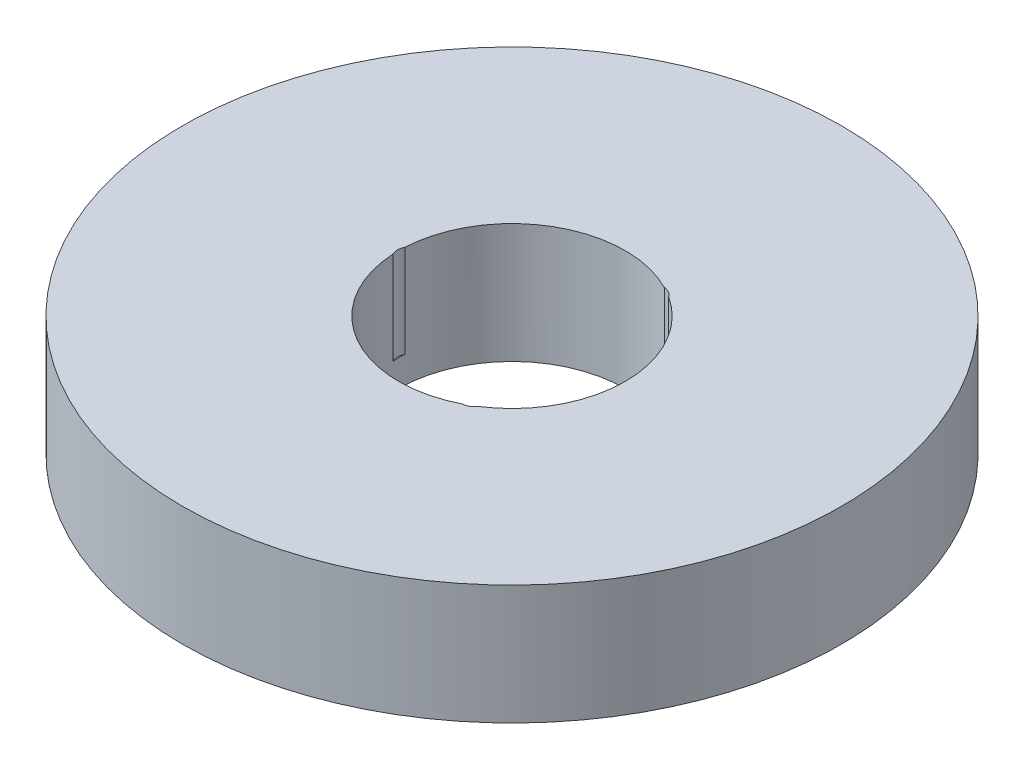
ISO-10303-21;
HEADER;
FILE_DESCRIPTION(('STEP AP214'),'2;1');
FILE_NAME('part.step','',(''),(''),'','','');
FILE_SCHEMA(('AUTOMOTIVE_DESIGN { 1 0 10303 214 1 1 1 1 }'));
ENDSEC;
DATA;
#1=APPLICATION_CONTEXT('core data for automotive mechanical design processes');
#2=APPLICATION_PROTOCOL_DEFINITION('international standard','automotive_design',2000,#1);
#3=PRODUCT_CONTEXT('',#1,'mechanical');
#4=PRODUCT('Part','Part','',(#3));
#5=PRODUCT_RELATED_PRODUCT_CATEGORY('part','',(#4));
#6=PRODUCT_DEFINITION_FORMATION('','',#4);
#7=PRODUCT_DEFINITION_CONTEXT('part definition',#1,'design');
#8=PRODUCT_DEFINITION('design','',#6,#7);
#9=PRODUCT_DEFINITION_SHAPE('','',#8);
#10=(LENGTH_UNIT() NAMED_UNIT(*) SI_UNIT(.MILLI.,.METRE.));
#11=(NAMED_UNIT(*) PLANE_ANGLE_UNIT() SI_UNIT($,.RADIAN.));
#12=(NAMED_UNIT(*) SI_UNIT($,.STERADIAN.) SOLID_ANGLE_UNIT());
#13=UNCERTAINTY_MEASURE_WITH_UNIT(LENGTH_MEASURE(1.E-05),#10,'distance_accuracy_value','');
#14=(GEOMETRIC_REPRESENTATION_CONTEXT(3) GLOBAL_UNCERTAINTY_ASSIGNED_CONTEXT((#13)) GLOBAL_UNIT_ASSIGNED_CONTEXT((#10,
#11,#12)) REPRESENTATION_CONTEXT('',''));
#15=CARTESIAN_POINT('',(0.,0.,0.));
#16=DIRECTION('',(0.,0.,1.));
#17=DIRECTION('',(1.,0.,0.));
#18=AXIS2_PLACEMENT_3D('',#15,#16,#17);
#19=CARTESIAN_POINT('',(0.,29.,0.));
#20=DIRECTION('',(0.,-1.,0.));
#21=DIRECTION('',(0.,0.,-1.));
#22=AXIS2_PLACEMENT_3D('',#19,#20,#21);
#23=CYLINDRICAL_SURFACE('',#22,80.);
#24=CARTESIAN_POINT('',(0.,29.,0.));
#25=DIRECTION('',(0.,1.,0.));
#26=DIRECTION('',(0.,0.,1.));
#27=AXIS2_PLACEMENT_3D('',#24,#25,#26);
#28=CIRCLE('',#27,80.);
#29=CARTESIAN_POINT('',(0.,29.,-80.));
#30=VERTEX_POINT('',#29);
#31=EDGE_CURVE('E130',#30,#30,#28,.T.);
#32=CARTESIAN_POINT('',(0.,0.,0.));
#33=DIRECTION('',(0.,1.,0.));
#34=DIRECTION('',(0.,0.,1.));
#35=AXIS2_PLACEMENT_3D('',#32,#33,#34);
#36=CIRCLE('',#35,80.);
#37=CARTESIAN_POINT('',(0.,0.,-80.));
#38=VERTEX_POINT('',#37);
#39=EDGE_CURVE('E117',#38,#38,#36,.T.);
#40=CARTESIAN_POINT('',(0.,29.,-80.));
#41=CARTESIAN_POINT('',(0.,28.6979166666667,-80.));
#42=CARTESIAN_POINT('',(0.,28.3958333333333,-80.));
#43=CARTESIAN_POINT('',(0.,27.7916666666667,-80.));
#44=CARTESIAN_POINT('',(0.,27.4895833333333,-80.));
#45=CARTESIAN_POINT('',(0.,26.8854166666667,-80.));
#46=CARTESIAN_POINT('',(0.,26.5833333333333,-80.));
#47=CARTESIAN_POINT('',(0.,25.9791666666667,-80.));
#48=CARTESIAN_POINT('',(0.,25.6770833333333,-80.));
#49=CARTESIAN_POINT('',(0.,25.0729166666667,-80.));
#50=CARTESIAN_POINT('',(0.,24.7708333333333,-80.));
#51=CARTESIAN_POINT('',(0.,24.1666666666667,-80.));
#52=CARTESIAN_POINT('',(0.,23.8645833333333,-80.));
#53=CARTESIAN_POINT('',(0.,23.2604166666667,-80.));
#54=CARTESIAN_POINT('',(0.,22.9583333333333,-80.));
#55=CARTESIAN_POINT('',(0.,22.3541666666667,-80.));
#56=CARTESIAN_POINT('',(0.,22.0520833333333,-80.));
#57=CARTESIAN_POINT('',(0.,21.4479166666667,-80.));
#58=CARTESIAN_POINT('',(0.,21.1458333333333,-80.));
#59=CARTESIAN_POINT('',(0.,20.5416666666667,-80.));
#60=CARTESIAN_POINT('',(0.,20.2395833333333,-80.));
#61=CARTESIAN_POINT('',(0.,19.6354166666667,-80.));
#62=CARTESIAN_POINT('',(0.,19.3333333333333,-80.));
#63=CARTESIAN_POINT('',(0.,18.7291666666667,-80.));
#64=CARTESIAN_POINT('',(0.,18.4270833333333,-80.));
#65=CARTESIAN_POINT('',(0.,17.8229166666667,-80.));
#66=CARTESIAN_POINT('',(0.,17.5208333333333,-80.));
#67=CARTESIAN_POINT('',(0.,16.9166666666667,-80.));
#68=CARTESIAN_POINT('',(0.,16.6145833333333,-80.));
#69=CARTESIAN_POINT('',(0.,16.0104166666667,-80.));
#70=CARTESIAN_POINT('',(0.,15.7083333333333,-80.));
#71=CARTESIAN_POINT('',(0.,15.1041666666667,-80.));
#72=CARTESIAN_POINT('',(0.,14.8020833333333,-80.));
#73=CARTESIAN_POINT('',(0.,14.1979166666667,-80.));
#74=CARTESIAN_POINT('',(0.,13.8958333333333,-80.));
#75=CARTESIAN_POINT('',(0.,13.2916666666667,-80.));
#76=CARTESIAN_POINT('',(0.,12.9895833333333,-80.));
#77=CARTESIAN_POINT('',(0.,12.3854166666667,-80.));
#78=CARTESIAN_POINT('',(0.,12.0833333333333,-80.));
#79=CARTESIAN_POINT('',(0.,11.4791666666667,-80.));
#80=CARTESIAN_POINT('',(0.,11.1770833333333,-80.));
#81=CARTESIAN_POINT('',(0.,10.5729166666667,-80.));
#82=CARTESIAN_POINT('',(0.,10.2708333333333,-80.));
#83=CARTESIAN_POINT('',(0.,9.66666666666667,-80.));
#84=CARTESIAN_POINT('',(0.,9.36458333333333,-80.));
#85=CARTESIAN_POINT('',(0.,8.76041666666667,-80.));
#86=CARTESIAN_POINT('',(0.,8.45833333333333,-80.));
#87=CARTESIAN_POINT('',(0.,7.85416666666667,-80.));
#88=CARTESIAN_POINT('',(0.,7.55208333333333,-80.));
#89=CARTESIAN_POINT('',(0.,6.94791666666667,-80.));
#90=CARTESIAN_POINT('',(0.,6.64583333333333,-80.));
#91=CARTESIAN_POINT('',(0.,6.04166666666667,-80.));
#92=CARTESIAN_POINT('',(0.,5.73958333333333,-80.));
#93=CARTESIAN_POINT('',(0.,5.13541666666667,-80.));
#94=CARTESIAN_POINT('',(0.,4.83333333333333,-80.));
#95=CARTESIAN_POINT('',(0.,4.22916666666667,-80.));
#96=CARTESIAN_POINT('',(0.,3.92708333333333,-80.));
#97=CARTESIAN_POINT('',(0.,3.32291666666667,-80.));
#98=CARTESIAN_POINT('',(0.,3.02083333333333,-80.));
#99=CARTESIAN_POINT('',(0.,2.41666666666667,-80.));
#100=CARTESIAN_POINT('',(0.,2.11458333333333,-80.));
#101=CARTESIAN_POINT('',(0.,1.51041666666667,-80.));
#102=CARTESIAN_POINT('',(0.,1.20833333333333,-80.));
#103=CARTESIAN_POINT('',(0.,0.604166666666667,-80.));
#104=CARTESIAN_POINT('',(0.,0.302083333333333,-80.));
#105=CARTESIAN_POINT('',(0.,0.,-80.));
#106=B_SPLINE_CURVE_WITH_KNOTS('',3,(#40,#41,#42,#43,#44,#45,#46,#47,#48,#49,#50,#51,#52,#53,
#54,#55,#56,#57,#58,#59,#60,#61,#62,#63,#64,#65,#66,#67,#68,#69,#70,#71,#72,#73,#74,#75,#76,#77,
#78,#79,#80,#81,#82,#83,#84,#85,#86,#87,#88,#89,#90,#91,#92,#93,#94,#95,#96,#97,#98,#99,#100,
#101,#102,#103,#104,#105),.UNSPECIFIED.,.F.,.F.,(4,2,2,2,2,2,2,2,2,2,2,2,2,2,2,2,2,2,2,2,2,2,2,
2,2,2,2,2,2,2,2,2,4),(0.,0.906249999999997,1.8125,2.71875,3.625,4.53125,5.4375,6.34375,7.25,
8.15625,9.0625,9.96875,10.875,11.78125,12.6875,13.59375,14.5,15.40625,16.3125,17.21875,18.125,
19.03125,19.9375,20.84375,21.75,22.65625,23.5625,24.46875,25.375,26.28125,27.1875,28.09375,29.),.UNSPECIFIED.);
#107=EDGE_CURVE('BSEAM39',#30,#38,#106,.T.);
#108=ORIENTED_EDGE('',*,*,#31,.F.);
#109=ORIENTED_EDGE('',*,*,#39,.T.);
#110=ORIENTED_EDGE('',*,*,#107,.T.);
#111=ORIENTED_EDGE('',*,*,#107,.F.);
#112=EDGE_LOOP('',(#108,#110,#109,#111));
#113=FACE_BOUND('',#112,.T.);
#114=ADVANCED_FACE('F39',(#113),#23,.T.);
#115=CARTESIAN_POINT('',(0.,29.,0.));
#116=DIRECTION('',(0.,1.,0.));
#117=DIRECTION('',(0.,0.,1.));
#118=AXIS2_PLACEMENT_3D('',#115,#116,#117);
#119=PLANE('',#118);
#120=CARTESIAN_POINT('',(12.3100000950475,29.,21.3215456057997));
#121=DIRECTION('',(0.,1.,0.));
#122=DIRECTION('',(0.866025403784436,0.,-0.500000000000004));
#123=AXIS2_PLACEMENT_3D('',#120,#121,#122);
#124=CIRCLE('',#123,3.18490358398607);
#125=CARTESIAN_POINT('',(12.4870001836295,29.,24.5015270220865));
#126=VERTEX_POINT('',#125);
#127=CARTESIAN_POINT('',(14.9754447408233,29.,23.0648228871272));
#128=VERTEX_POINT('',#127);
#129=EDGE_CURVE('E148',#126,#128,#124,.T.);
#130=ORIENTED_EDGE('',*,*,#129,.F.);
#131=CARTESIAN_POINT('',(0.,29.,0.));
#132=DIRECTION('',(0.,1.,0.));
#133=DIRECTION('',(0.,0.,1.));
#134=AXIS2_PLACEMENT_3D('',#131,#132,#133);
#135=CIRCLE('',#134,27.5);
#136=CARTESIAN_POINT('',(-27.4624449244526,29.,1.43670413495925));
#137=VERTEX_POINT('',#136);
#138=EDGE_CURVE('E113',#137,#126,#135,.T.);
#139=ORIENTED_EDGE('',*,*,#138,.F.);
#140=CARTESIAN_POINT('',(-24.6200001900948,29.,0.));
#141=DIRECTION('',(0.,1.,0.));
#142=DIRECTION('',(0.,0.,1.));
#143=AXIS2_PLACEMENT_3D('',#140,#141,#142);
#144=CIRCLE('',#143,3.18490358398607);
#145=CARTESIAN_POINT('',(-27.4624449244526,29.,-1.43670413495925));
#146=VERTEX_POINT('',#145);
#147=EDGE_CURVE('E125',#146,#137,#144,.T.);
#148=ORIENTED_EDGE('',*,*,#147,.F.);
#149=CARTESIAN_POINT('',(12.4870001836292,29.,-24.5015270220867));
#150=VERTEX_POINT('',#149);
#151=EDGE_CURVE('E107',#150,#146,#135,.T.);
#152=ORIENTED_EDGE('',*,*,#151,.F.);
#153=CARTESIAN_POINT('',(12.3100000950472,29.,-21.3215456057999));
#154=DIRECTION('',(0.,1.,0.));
#155=DIRECTION('',(-0.866025403784443,0.,-0.499999999999992));
#156=AXIS2_PLACEMENT_3D('',#153,#154,#155);
#157=CIRCLE('',#156,3.18490358398607);
#158=CARTESIAN_POINT('',(14.9754447408229,29.,-23.0648228871275));
#159=VERTEX_POINT('',#158);
#160=EDGE_CURVE('E95',#159,#150,#157,.T.);
#161=ORIENTED_EDGE('',*,*,#160,.F.);
#162=EDGE_CURVE('E106',#128,#159,#135,.T.);
#163=ORIENTED_EDGE('',*,*,#162,.F.);
#164=EDGE_LOOP('',(#130,#139,#148,#152,#161,#163));
#165=FACE_BOUND('',#164,.T.);
#166=ORIENTED_EDGE('',*,*,#31,.T.);
#167=EDGE_LOOP('',(#166));
#168=FACE_BOUND('',#167,.T.);
#169=ADVANCED_FACE('F102',(#165,#168),#119,.T.);
#170=CARTESIAN_POINT('',(0.,0.,0.));
#171=DIRECTION('',(0.,1.,0.));
#172=DIRECTION('',(0.,0.,1.));
#173=AXIS2_PLACEMENT_3D('',#170,#171,#172);
#174=PLANE('',#173);
#175=CARTESIAN_POINT('',(0.,0.,0.));
#176=DIRECTION('',(0.,1.,0.));
#177=DIRECTION('',(0.,0.,1.));
#178=AXIS2_PLACEMENT_3D('',#175,#176,#177);
#179=CIRCLE('',#178,27.5);
#180=CARTESIAN_POINT('',(0.,0.,27.5));
#181=VERTEX_POINT('',#180);
#182=EDGE_CURVE('E118',#181,#181,#179,.T.);
#183=ORIENTED_EDGE('',*,*,#182,.T.);
#184=EDGE_LOOP('',(#183));
#185=FACE_BOUND('',#184,.T.);
#186=ORIENTED_EDGE('',*,*,#39,.F.);
#187=EDGE_LOOP('',(#186));
#188=FACE_BOUND('',#187,.T.);
#189=ADVANCED_FACE('F161',(#185,#188),#174,.F.);
#190=CARTESIAN_POINT('',(0.,29.,0.));
#191=DIRECTION('',(0.,-1.,0.));
#192=DIRECTION('',(0.,0.,-1.));
#193=AXIS2_PLACEMENT_3D('',#190,#191,#192);
#194=CYLINDRICAL_SURFACE('',#193,27.5);
#195=DIRECTION('',(0.,1.,0.));
#196=VECTOR('',#195,1.);
#197=CARTESIAN_POINT('',(12.4870001836295,17.7404826044888,24.5015270220865));
#198=LINE('',#197,#196);
#199=CARTESIAN_POINT('',(12.4870001836295,6.48096520897766,24.5015270220865));
#200=VERTEX_POINT('',#199);
#201=EDGE_CURVE('E11',#200,#126,#198,.T.);
#202=ORIENTED_EDGE('',*,*,#201,.F.);
#203=CARTESIAN_POINT('',(0.,6.48096520897766,0.));
#204=DIRECTION('',(0.,1.,0.));
#205=DIRECTION('',(0.,0.,1.));
#206=AXIS2_PLACEMENT_3D('',#203,#204,#205);
#207=CIRCLE('',#206,27.5);
#208=CARTESIAN_POINT('',(14.9754447408233,6.48096520897766,23.0648228871272));
#209=VERTEX_POINT('',#208);
#210=EDGE_CURVE('E100',#200,#209,#207,.T.);
#211=ORIENTED_EDGE('',*,*,#210,.T.);
#212=DIRECTION('',(0.,1.,0.));
#213=VECTOR('',#212,1.);
#214=CARTESIAN_POINT('',(14.9754447408233,17.7404826044888,23.0648228871272));
#215=LINE('',#214,#213);
#216=EDGE_CURVE('E46',#128,#209,#215,.F.);
#217=ORIENTED_EDGE('',*,*,#216,.F.);
#218=ORIENTED_EDGE('',*,*,#162,.T.);
#219=DIRECTION('',(0.,1.,0.));
#220=VECTOR('',#219,1.);
#221=CARTESIAN_POINT('',(14.975444740823,17.7404826044888,-23.0648228871274));
#222=LINE('',#221,#220);
#223=CARTESIAN_POINT('',(14.9754447408229,6.48096520897766,-23.0648228871275));
#224=VERTEX_POINT('',#223);
#225=EDGE_CURVE('E90',#224,#159,#222,.T.);
#226=ORIENTED_EDGE('',*,*,#225,.F.);
#227=CARTESIAN_POINT('',(0.,6.48096520897766,0.));
#228=DIRECTION('',(0.,1.,0.));
#229=DIRECTION('',(0.,0.,1.));
#230=AXIS2_PLACEMENT_3D('',#227,#228,#229);
#231=CIRCLE('',#230,27.5);
#232=CARTESIAN_POINT('',(12.4870001836292,6.48096520897766,-24.5015270220867));
#233=VERTEX_POINT('',#232);
#234=EDGE_CURVE('E143',#224,#233,#231,.T.);
#235=ORIENTED_EDGE('',*,*,#234,.T.);
#236=DIRECTION('',(0.,1.,0.));
#237=VECTOR('',#236,1.);
#238=CARTESIAN_POINT('',(12.4870001836292,17.7404826044888,-24.5015270220867));
#239=LINE('',#238,#237);
#240=EDGE_CURVE('E98',#150,#233,#239,.F.);
#241=ORIENTED_EDGE('',*,*,#240,.F.);
#242=ORIENTED_EDGE('',*,*,#151,.T.);
#243=DIRECTION('',(0.,1.,0.));
#244=VECTOR('',#243,1.);
#245=CARTESIAN_POINT('',(-27.4624449244526,17.7404826044888,-1.43670413495928));
#246=LINE('',#245,#244);
#247=CARTESIAN_POINT('',(-27.4624449244526,6.48096520897766,-1.43670413495925));
#248=VERTEX_POINT('',#247);
#249=EDGE_CURVE('E137',#248,#146,#246,.T.);
#250=ORIENTED_EDGE('',*,*,#249,.F.);
#251=CARTESIAN_POINT('',(0.,6.48096520897766,0.));
#252=DIRECTION('',(0.,1.,0.));
#253=DIRECTION('',(0.,0.,1.));
#254=AXIS2_PLACEMENT_3D('',#251,#252,#253);
#255=CIRCLE('',#254,27.5);
#256=CARTESIAN_POINT('',(-27.4624449244526,6.48096520897766,1.43670413495925));
#257=VERTEX_POINT('',#256);
#258=EDGE_CURVE('E128',#248,#257,#255,.T.);
#259=ORIENTED_EDGE('',*,*,#258,.T.);
#260=DIRECTION('',(0.,1.,0.));
#261=VECTOR('',#260,1.);
#262=CARTESIAN_POINT('',(-27.4624449244526,17.7404826044888,1.43670413495928));
#263=LINE('',#262,#261);
#264=EDGE_CURVE('E134',#137,#257,#263,.F.);
#265=ORIENTED_EDGE('',*,*,#264,.F.);
#266=ORIENTED_EDGE('',*,*,#138,.T.);
#267=EDGE_LOOP('',(#202,#211,#217,#218,#226,#235,#241,#242,#250,#259,#265,#266));
#268=FACE_BOUND('',#267,.T.);
#269=ORIENTED_EDGE('',*,*,#182,.F.);
#270=EDGE_LOOP('',(#269));
#271=FACE_BOUND('',#270,.T.);
#272=ADVANCED_FACE('F115',(#268,#271),#194,.F.);
#273=CARTESIAN_POINT('',(-24.6200001900948,6.48096520897766,0.));
#274=DIRECTION('',(0.,1.,0.));
#275=DIRECTION('',(0.,0.,1.));
#276=AXIS2_PLACEMENT_3D('',#273,#274,#275);
#277=CYLINDRICAL_SURFACE('',#276,3.18490358398607);
#278=ORIENTED_EDGE('',*,*,#249,.T.);
#279=ORIENTED_EDGE('',*,*,#147,.T.);
#280=ORIENTED_EDGE('',*,*,#264,.T.);
#281=CARTESIAN_POINT('',(-24.6200001900948,6.48096520897766,0.));
#282=DIRECTION('',(0.,1.,0.));
#283=DIRECTION('',(0.,0.,1.));
#284=AXIS2_PLACEMENT_3D('',#281,#282,#283);
#285=CIRCLE('',#284,3.18490358398607);
#286=EDGE_CURVE('E127',#248,#257,#285,.T.);
#287=ORIENTED_EDGE('',*,*,#286,.F.);
#288=EDGE_LOOP('',(#278,#279,#280,#287));
#289=FACE_BOUND('',#288,.T.);
#290=ADVANCED_FACE('F175',(#289),#277,.F.);
#291=CARTESIAN_POINT('',(-24.6200001900948,6.48096520897766,0.));
#292=DIRECTION('',(0.,1.,0.));
#293=DIRECTION('',(0.,0.,1.));
#294=AXIS2_PLACEMENT_3D('',#291,#292,#293);
#295=PLANE('',#294);
#296=ORIENTED_EDGE('',*,*,#286,.T.);
#297=ORIENTED_EDGE('',*,*,#258,.F.);
#298=EDGE_LOOP('',(#296,#297));
#299=FACE_BOUND('',#298,.T.);
#300=ADVANCED_FACE('F176',(#299),#295,.T.);
#301=CARTESIAN_POINT('',(12.3100000950472,6.48096520897766,-21.3215456057999));
#302=DIRECTION('',(0.,1.,0.));
#303=DIRECTION('',(0.,0.,1.));
#304=AXIS2_PLACEMENT_3D('',#301,#302,#303);
#305=CYLINDRICAL_SURFACE('',#304,3.18490358398607);
#306=ORIENTED_EDGE('',*,*,#225,.T.);
#307=ORIENTED_EDGE('',*,*,#160,.T.);
#308=ORIENTED_EDGE('',*,*,#240,.T.);
#309=CARTESIAN_POINT('',(12.3100000950472,6.48096520897766,-21.3215456057999));
#310=DIRECTION('',(0.,1.,0.));
#311=DIRECTION('',(-0.866025403784443,0.,-0.499999999999992));
#312=AXIS2_PLACEMENT_3D('',#309,#310,#311);
#313=CIRCLE('',#312,3.18490358398607);
#314=EDGE_CURVE('E56',#224,#233,#313,.T.);
#315=ORIENTED_EDGE('',*,*,#314,.F.);
#316=EDGE_LOOP('',(#306,#307,#308,#315));
#317=FACE_BOUND('',#316,.T.);
#318=ADVANCED_FACE('F93',(#317),#305,.F.);
#319=CARTESIAN_POINT('',(12.3100000950472,6.48096520897766,-21.3215456057999));
#320=DIRECTION('',(0.,1.,0.));
#321=DIRECTION('',(-0.866025403784443,0.,-0.499999999999992));
#322=AXIS2_PLACEMENT_3D('',#319,#320,#321);
#323=PLANE('',#322);
#324=ORIENTED_EDGE('',*,*,#314,.T.);
#325=ORIENTED_EDGE('',*,*,#234,.F.);
#326=EDGE_LOOP('',(#324,#325));
#327=FACE_BOUND('',#326,.T.);
#328=ADVANCED_FACE('F153',(#327),#323,.T.);
#329=CARTESIAN_POINT('',(12.3100000950475,6.48096520897766,21.3215456057997));
#330=DIRECTION('',(0.,1.,0.));
#331=DIRECTION('',(0.,0.,1.));
#332=AXIS2_PLACEMENT_3D('',#329,#330,#331);
#333=CYLINDRICAL_SURFACE('',#332,3.18490358398607);
#334=ORIENTED_EDGE('',*,*,#201,.T.);
#335=ORIENTED_EDGE('',*,*,#129,.T.);
#336=ORIENTED_EDGE('',*,*,#216,.T.);
#337=CARTESIAN_POINT('',(12.3100000950475,6.48096520897766,21.3215456057997));
#338=DIRECTION('',(0.,1.,0.));
#339=DIRECTION('',(0.866025403784436,0.,-0.500000000000004));
#340=AXIS2_PLACEMENT_3D('',#337,#338,#339);
#341=CIRCLE('',#340,3.18490358398607);
#342=EDGE_CURVE('E55',#200,#209,#341,.T.);
#343=ORIENTED_EDGE('',*,*,#342,.F.);
#344=EDGE_LOOP('',(#334,#335,#336,#343));
#345=FACE_BOUND('',#344,.T.);
#346=ADVANCED_FACE('F144',(#345),#333,.F.);
#347=CARTESIAN_POINT('',(12.3100000950475,6.48096520897766,21.3215456057997));
#348=DIRECTION('',(0.,1.,0.));
#349=DIRECTION('',(0.866025403784436,0.,-0.500000000000004));
#350=AXIS2_PLACEMENT_3D('',#347,#348,#349);
#351=PLANE('',#350);
#352=ORIENTED_EDGE('',*,*,#342,.T.);
#353=ORIENTED_EDGE('',*,*,#210,.F.);
#354=EDGE_LOOP('',(#352,#353));
#355=FACE_BOUND('',#354,.T.);
#356=ADVANCED_FACE('F150',(#355),#351,.T.);
#357=CLOSED_SHELL('',(#114,#169,#189,#272,#290,#300,#318,#328,#346,#356));
#358=MANIFOLD_SOLID_BREP('B2',#357);
#359=ADVANCED_BREP_SHAPE_REPRESENTATION('',(#18,#358),#14);
#360=SHAPE_DEFINITION_REPRESENTATION(#9,#359);
ENDSEC;
END-ISO-10303-21;
